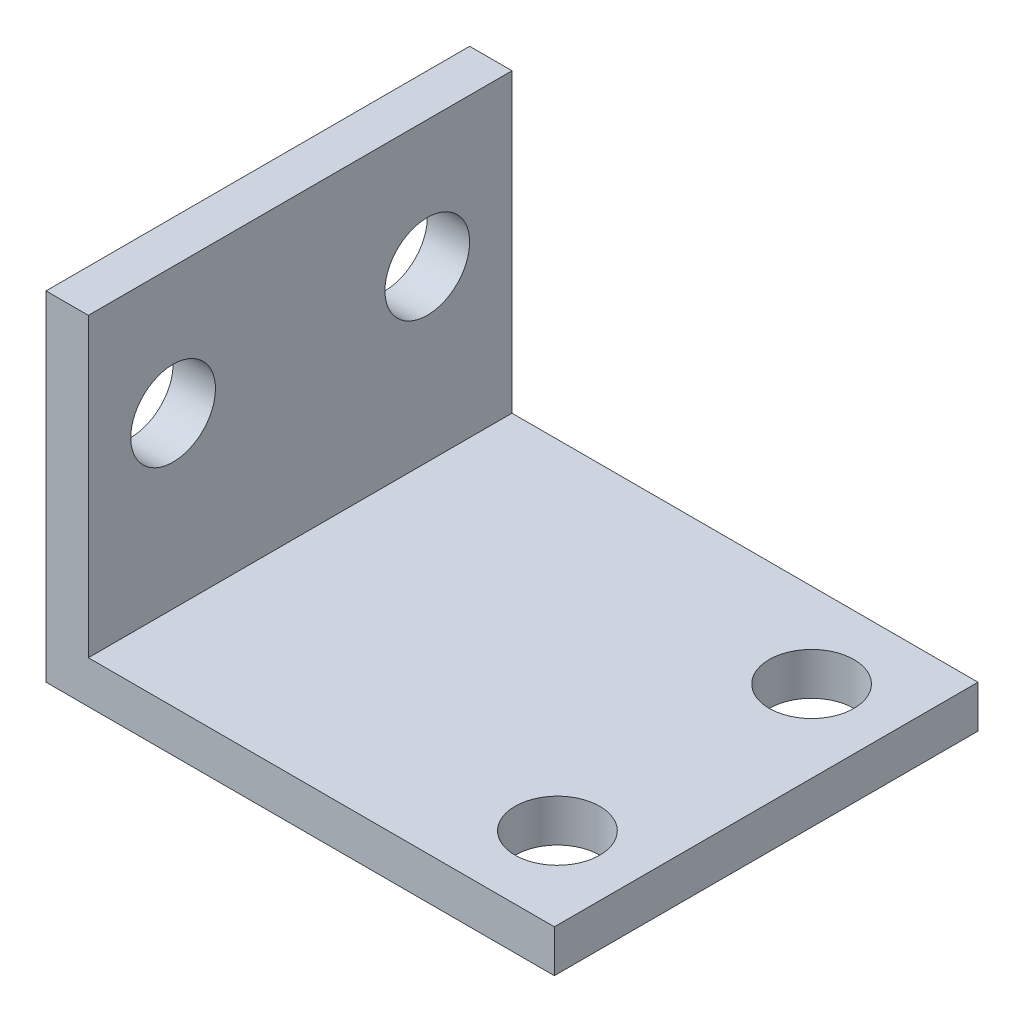
ISO-10303-21;
HEADER;
FILE_DESCRIPTION(('STEP AP214'),'2;1');
FILE_NAME('part.step','',(''),(''),'','','');
FILE_SCHEMA(('AUTOMOTIVE_DESIGN { 1 0 10303 214 1 1 1 1 }'));
ENDSEC;
DATA;
#1=APPLICATION_CONTEXT('core data for automotive mechanical design processes');
#2=APPLICATION_PROTOCOL_DEFINITION('international standard','automotive_design',2000,#1);
#3=PRODUCT_CONTEXT('',#1,'mechanical');
#4=PRODUCT('Part','Part','',(#3));
#5=PRODUCT_RELATED_PRODUCT_CATEGORY('part','',(#4));
#6=PRODUCT_DEFINITION_FORMATION('','',#4);
#7=PRODUCT_DEFINITION_CONTEXT('part definition',#1,'design');
#8=PRODUCT_DEFINITION('design','',#6,#7);
#9=PRODUCT_DEFINITION_SHAPE('','',#8);
#10=(LENGTH_UNIT() NAMED_UNIT(*) SI_UNIT(.MILLI.,.METRE.));
#11=(NAMED_UNIT(*) PLANE_ANGLE_UNIT() SI_UNIT($,.RADIAN.));
#12=(NAMED_UNIT(*) SI_UNIT($,.STERADIAN.) SOLID_ANGLE_UNIT());
#13=UNCERTAINTY_MEASURE_WITH_UNIT(LENGTH_MEASURE(1.E-05),#10,'distance_accuracy_value','');
#14=(GEOMETRIC_REPRESENTATION_CONTEXT(3) GLOBAL_UNCERTAINTY_ASSIGNED_CONTEXT((#13)) GLOBAL_UNIT_ASSIGNED_CONTEXT((#10,
#11,#12)) REPRESENTATION_CONTEXT('',''));
#15=CARTESIAN_POINT('',(0.,0.,0.));
#16=DIRECTION('',(0.,0.,1.));
#17=DIRECTION('',(1.,0.,0.));
#18=AXIS2_PLACEMENT_3D('',#15,#16,#17);
#19=CARTESIAN_POINT('',(38.1,0.,31.75));
#20=DIRECTION('',(0.,1.,0.));
#21=DIRECTION('',(-1.,0.,0.));
#22=AXIS2_PLACEMENT_3D('',#19,#20,#21);
#23=PLANE('',#22);
#24=CARTESIAN_POINT('',(31.9786,0.,25.4));
#25=DIRECTION('',(0.,1.,0.));
#26=DIRECTION('',(-1.,0.,0.));
#27=AXIS2_PLACEMENT_3D('',#24,#25,#26);
#28=CIRCLE('',#27,3.175);
#29=CARTESIAN_POINT('',(28.8036,0.,25.4));
#30=VERTEX_POINT('',#29);
#31=EDGE_CURVE('E162',#30,#30,#28,.T.);
#32=ORIENTED_EDGE('',*,*,#31,.T.);
#33=EDGE_LOOP('',(#32));
#34=FACE_BOUND('',#33,.T.);
#35=CARTESIAN_POINT('',(31.9786,0.,6.35));
#36=DIRECTION('',(0.,1.,0.));
#37=DIRECTION('',(-1.,0.,0.));
#38=AXIS2_PLACEMENT_3D('',#35,#36,#37);
#39=CIRCLE('',#38,3.175);
#40=CARTESIAN_POINT('',(28.8036,0.,6.35));
#41=VERTEX_POINT('',#40);
#42=EDGE_CURVE('E120',#41,#41,#39,.T.);
#43=ORIENTED_EDGE('',*,*,#42,.T.);
#44=EDGE_LOOP('',(#43));
#45=FACE_BOUND('',#44,.T.);
#46=DIRECTION('',(1.,0.,0.));
#47=VECTOR('',#46,1.);
#48=CARTESIAN_POINT('',(38.1,0.,0.));
#49=LINE('',#48,#47);
#50=CARTESIAN_POINT('',(0.,0.,0.));
#51=VERTEX_POINT('',#50);
#52=CARTESIAN_POINT('',(38.1,0.,0.));
#53=VERTEX_POINT('',#52);
#54=EDGE_CURVE('E116',#51,#53,#49,.T.);
#55=ORIENTED_EDGE('',*,*,#54,.T.);
#56=DIRECTION('',(0.,0.,-1.));
#57=VECTOR('',#56,1.);
#58=CARTESIAN_POINT('',(38.1,0.,31.75));
#59=LINE('',#58,#57);
#60=CARTESIAN_POINT('',(38.1,0.,31.75));
#61=VERTEX_POINT('',#60);
#62=EDGE_CURVE('E11',#61,#53,#59,.T.);
#63=ORIENTED_EDGE('',*,*,#62,.F.);
#64=DIRECTION('',(1.,0.,0.));
#65=VECTOR('',#64,1.);
#66=CARTESIAN_POINT('',(38.1,0.,31.75));
#67=LINE('',#66,#65);
#68=CARTESIAN_POINT('',(0.,0.,31.75));
#69=VERTEX_POINT('',#68);
#70=EDGE_CURVE('E127',#69,#61,#67,.T.);
#71=ORIENTED_EDGE('',*,*,#70,.F.);
#72=DIRECTION('',(0.,0.,-1.));
#73=VECTOR('',#72,1.);
#74=CARTESIAN_POINT('',(0.,0.,31.75));
#75=LINE('',#74,#73);
#76=EDGE_CURVE('E112',#69,#51,#75,.T.);
#77=ORIENTED_EDGE('',*,*,#76,.T.);
#78=EDGE_LOOP('',(#55,#63,#71,#77));
#79=FACE_BOUND('',#78,.T.);
#80=ADVANCED_FACE('F32',(#34,#45,#79),#23,.F.);
#81=CARTESIAN_POINT('',(38.1,3.175,31.75));
#82=DIRECTION('',(-1.,0.,0.));
#83=DIRECTION('',(0.,0.,1.));
#84=AXIS2_PLACEMENT_3D('',#81,#82,#83);
#85=PLANE('',#84);
#86=DIRECTION('',(0.,1.,0.));
#87=VECTOR('',#86,1.);
#88=CARTESIAN_POINT('',(38.1,3.175,0.));
#89=LINE('',#88,#87);
#90=CARTESIAN_POINT('',(38.1,3.175,0.));
#91=VERTEX_POINT('',#90);
#92=EDGE_CURVE('E119',#53,#91,#89,.T.);
#93=ORIENTED_EDGE('',*,*,#92,.T.);
#94=DIRECTION('',(0.,0.,-1.));
#95=VECTOR('',#94,1.);
#96=CARTESIAN_POINT('',(38.1,3.175,31.75));
#97=LINE('',#96,#95);
#98=CARTESIAN_POINT('',(38.1,3.175,31.75));
#99=VERTEX_POINT('',#98);
#100=EDGE_CURVE('E40',#99,#91,#97,.T.);
#101=ORIENTED_EDGE('',*,*,#100,.F.);
#102=DIRECTION('',(0.,1.,0.));
#103=VECTOR('',#102,1.);
#104=CARTESIAN_POINT('',(38.1,3.175,31.75));
#105=LINE('',#104,#103);
#106=EDGE_CURVE('E85',#61,#99,#105,.T.);
#107=ORIENTED_EDGE('',*,*,#106,.F.);
#108=ORIENTED_EDGE('',*,*,#62,.T.);
#109=EDGE_LOOP('',(#93,#101,#107,#108));
#110=FACE_BOUND('',#109,.T.);
#111=ADVANCED_FACE('F154',(#110),#85,.F.);
#112=CARTESIAN_POINT('',(3.17500000000001,3.175,31.75));
#113=DIRECTION('',(0.,-1.,0.));
#114=DIRECTION('',(1.,0.,0.));
#115=AXIS2_PLACEMENT_3D('',#112,#113,#114);
#116=PLANE('',#115);
#117=CARTESIAN_POINT('',(31.9786,3.175,25.4));
#118=DIRECTION('',(0.,1.,0.));
#119=DIRECTION('',(-1.,0.,0.));
#120=AXIS2_PLACEMENT_3D('',#117,#118,#119);
#121=CIRCLE('',#120,3.175);
#122=CARTESIAN_POINT('',(28.8036,3.175,25.4));
#123=VERTEX_POINT('',#122);
#124=EDGE_CURVE('E171',#123,#123,#121,.T.);
#125=ORIENTED_EDGE('',*,*,#124,.F.);
#126=EDGE_LOOP('',(#125));
#127=FACE_BOUND('',#126,.T.);
#128=CARTESIAN_POINT('',(31.9786,3.175,6.35));
#129=DIRECTION('',(0.,1.,0.));
#130=DIRECTION('',(-1.,0.,0.));
#131=AXIS2_PLACEMENT_3D('',#128,#129,#130);
#132=CIRCLE('',#131,3.175);
#133=CARTESIAN_POINT('',(28.8036,3.175,6.35));
#134=VERTEX_POINT('',#133);
#135=EDGE_CURVE('E166',#134,#134,#132,.T.);
#136=ORIENTED_EDGE('',*,*,#135,.F.);
#137=EDGE_LOOP('',(#136));
#138=FACE_BOUND('',#137,.T.);
#139=DIRECTION('',(-1.,0.,0.));
#140=VECTOR('',#139,1.);
#141=CARTESIAN_POINT('',(3.17500000000001,3.175,0.));
#142=LINE('',#141,#140);
#143=CARTESIAN_POINT('',(3.17500000000001,3.175,0.));
#144=VERTEX_POINT('',#143);
#145=EDGE_CURVE('E122',#91,#144,#142,.T.);
#146=ORIENTED_EDGE('',*,*,#145,.T.);
#147=DIRECTION('',(0.,0.,-1.));
#148=VECTOR('',#147,1.);
#149=CARTESIAN_POINT('',(3.17500000000001,3.175,31.75));
#150=LINE('',#149,#148);
#151=CARTESIAN_POINT('',(3.17500000000001,3.175,31.75));
#152=VERTEX_POINT('',#151);
#153=EDGE_CURVE('E107',#152,#144,#150,.T.);
#154=ORIENTED_EDGE('',*,*,#153,.F.);
#155=DIRECTION('',(-1.,0.,0.));
#156=VECTOR('',#155,1.);
#157=CARTESIAN_POINT('',(3.17500000000001,3.175,31.75));
#158=LINE('',#157,#156);
#159=EDGE_CURVE('E98',#99,#152,#158,.T.);
#160=ORIENTED_EDGE('',*,*,#159,.F.);
#161=ORIENTED_EDGE('',*,*,#100,.T.);
#162=EDGE_LOOP('',(#146,#154,#160,#161));
#163=FACE_BOUND('',#162,.T.);
#164=ADVANCED_FACE('F133',(#127,#138,#163),#116,.F.);
#165=CARTESIAN_POINT('',(3.175,25.4,31.75));
#166=DIRECTION('',(-1.,0.,0.));
#167=DIRECTION('',(0.,-1.,0.));
#168=AXIS2_PLACEMENT_3D('',#165,#166,#167);
#169=PLANE('',#168);
#170=CARTESIAN_POINT('',(3.175,15.875,6.35));
#171=DIRECTION('',(1.,0.,0.));
#172=DIRECTION('',(0.,1.,0.));
#173=AXIS2_PLACEMENT_3D('',#170,#171,#172);
#174=CIRCLE('',#173,3.175);
#175=CARTESIAN_POINT('',(3.175,19.05,6.35));
#176=VERTEX_POINT('',#175);
#177=EDGE_CURVE('E184',#176,#176,#174,.T.);
#178=ORIENTED_EDGE('',*,*,#177,.F.);
#179=EDGE_LOOP('',(#178));
#180=FACE_BOUND('',#179,.T.);
#181=CARTESIAN_POINT('',(3.175,15.875,25.4));
#182=DIRECTION('',(1.,0.,0.));
#183=DIRECTION('',(0.,1.,0.));
#184=AXIS2_PLACEMENT_3D('',#181,#182,#183);
#185=CIRCLE('',#184,3.175);
#186=CARTESIAN_POINT('',(3.175,19.05,25.4));
#187=VERTEX_POINT('',#186);
#188=EDGE_CURVE('E178',#187,#187,#185,.T.);
#189=ORIENTED_EDGE('',*,*,#188,.F.);
#190=EDGE_LOOP('',(#189));
#191=FACE_BOUND('',#190,.T.);
#192=DIRECTION('',(0.,1.,0.));
#193=VECTOR('',#192,1.);
#194=CARTESIAN_POINT('',(3.175,25.4,0.));
#195=LINE('',#194,#193);
#196=CARTESIAN_POINT('',(3.175,25.4,0.));
#197=VERTEX_POINT('',#196);
#198=EDGE_CURVE('E106',#144,#197,#195,.T.);
#199=ORIENTED_EDGE('',*,*,#198,.T.);
#200=DIRECTION('',(0.,0.,-1.));
#201=VECTOR('',#200,1.);
#202=CARTESIAN_POINT('',(3.175,25.4,31.75));
#203=LINE('',#202,#201);
#204=CARTESIAN_POINT('',(3.175,25.4,31.75));
#205=VERTEX_POINT('',#204);
#206=EDGE_CURVE('E103',#205,#197,#203,.T.);
#207=ORIENTED_EDGE('',*,*,#206,.F.);
#208=DIRECTION('',(0.,1.,0.));
#209=VECTOR('',#208,1.);
#210=CARTESIAN_POINT('',(3.175,25.4,31.75));
#211=LINE('',#210,#209);
#212=EDGE_CURVE('E92',#152,#205,#211,.T.);
#213=ORIENTED_EDGE('',*,*,#212,.F.);
#214=ORIENTED_EDGE('',*,*,#153,.T.);
#215=EDGE_LOOP('',(#199,#207,#213,#214));
#216=FACE_BOUND('',#215,.T.);
#217=ADVANCED_FACE('F104',(#180,#191,#216),#169,.F.);
#218=CARTESIAN_POINT('',(0.,25.4,31.75));
#219=DIRECTION('',(0.,-1.,0.));
#220=DIRECTION('',(0.,0.,-1.));
#221=AXIS2_PLACEMENT_3D('',#218,#219,#220);
#222=PLANE('',#221);
#223=DIRECTION('',(-1.,0.,0.));
#224=VECTOR('',#223,1.);
#225=CARTESIAN_POINT('',(0.,25.4,0.));
#226=LINE('',#225,#224);
#227=CARTESIAN_POINT('',(0.,25.4,0.));
#228=VERTEX_POINT('',#227);
#229=EDGE_CURVE('E71',#197,#228,#226,.T.);
#230=ORIENTED_EDGE('',*,*,#229,.T.);
#231=DIRECTION('',(0.,0.,-1.));
#232=VECTOR('',#231,1.);
#233=CARTESIAN_POINT('',(0.,25.4,31.75));
#234=LINE('',#233,#232);
#235=CARTESIAN_POINT('',(0.,25.4,31.75));
#236=VERTEX_POINT('',#235);
#237=EDGE_CURVE('E108',#236,#228,#234,.T.);
#238=ORIENTED_EDGE('',*,*,#237,.F.);
#239=DIRECTION('',(-1.,0.,0.));
#240=VECTOR('',#239,1.);
#241=CARTESIAN_POINT('',(0.,25.4,31.75));
#242=LINE('',#241,#240);
#243=EDGE_CURVE('E96',#205,#236,#242,.T.);
#244=ORIENTED_EDGE('',*,*,#243,.F.);
#245=ORIENTED_EDGE('',*,*,#206,.T.);
#246=EDGE_LOOP('',(#230,#238,#244,#245));
#247=FACE_BOUND('',#246,.T.);
#248=ADVANCED_FACE('F110',(#247),#222,.F.);
#249=CARTESIAN_POINT('',(0.,0.,31.75));
#250=DIRECTION('',(1.,0.,0.));
#251=DIRECTION('',(0.,0.,-1.));
#252=AXIS2_PLACEMENT_3D('',#249,#250,#251);
#253=PLANE('',#252);
#254=CARTESIAN_POINT('',(0.,15.875,6.35));
#255=DIRECTION('',(1.,0.,0.));
#256=DIRECTION('',(0.,1.,0.));
#257=AXIS2_PLACEMENT_3D('',#254,#255,#256);
#258=CIRCLE('',#257,3.175);
#259=CARTESIAN_POINT('',(0.,19.05,6.35));
#260=VERTEX_POINT('',#259);
#261=EDGE_CURVE('E181',#260,#260,#258,.T.);
#262=ORIENTED_EDGE('',*,*,#261,.T.);
#263=EDGE_LOOP('',(#262));
#264=FACE_BOUND('',#263,.T.);
#265=CARTESIAN_POINT('',(0.,15.875,25.4));
#266=DIRECTION('',(1.,0.,0.));
#267=DIRECTION('',(0.,1.,0.));
#268=AXIS2_PLACEMENT_3D('',#265,#266,#267);
#269=CIRCLE('',#268,3.175);
#270=CARTESIAN_POINT('',(0.,19.05,25.4));
#271=VERTEX_POINT('',#270);
#272=EDGE_CURVE('E176',#271,#271,#269,.T.);
#273=ORIENTED_EDGE('',*,*,#272,.T.);
#274=EDGE_LOOP('',(#273));
#275=FACE_BOUND('',#274,.T.);
#276=DIRECTION('',(0.,-1.,0.));
#277=VECTOR('',#276,1.);
#278=CARTESIAN_POINT('',(0.,0.,0.));
#279=LINE('',#278,#277);
#280=EDGE_CURVE('E77',#228,#51,#279,.T.);
#281=ORIENTED_EDGE('',*,*,#280,.T.);
#282=ORIENTED_EDGE('',*,*,#76,.F.);
#283=DIRECTION('',(0.,-1.,0.));
#284=VECTOR('',#283,1.);
#285=CARTESIAN_POINT('',(0.,0.,31.75));
#286=LINE('',#285,#284);
#287=EDGE_CURVE('E48',#236,#69,#286,.T.);
#288=ORIENTED_EDGE('',*,*,#287,.F.);
#289=ORIENTED_EDGE('',*,*,#237,.T.);
#290=EDGE_LOOP('',(#281,#282,#288,#289));
#291=FACE_BOUND('',#290,.T.);
#292=ADVANCED_FACE('F140',(#264,#275,#291),#253,.F.);
#293=CARTESIAN_POINT('',(0.,0.,31.75));
#294=DIRECTION('',(0.,0.,-1.));
#295=DIRECTION('',(-1.,0.,0.));
#296=AXIS2_PLACEMENT_3D('',#293,#294,#295);
#297=PLANE('',#296);
#298=ORIENTED_EDGE('',*,*,#70,.T.);
#299=ORIENTED_EDGE('',*,*,#106,.T.);
#300=ORIENTED_EDGE('',*,*,#159,.T.);
#301=ORIENTED_EDGE('',*,*,#212,.T.);
#302=ORIENTED_EDGE('',*,*,#243,.T.);
#303=ORIENTED_EDGE('',*,*,#287,.T.);
#304=EDGE_LOOP('',(#298,#299,#300,#301,#302,#303));
#305=FACE_BOUND('',#304,.T.);
#306=ADVANCED_FACE('F94',(#305),#297,.F.);
#307=CARTESIAN_POINT('',(0.,0.,0.));
#308=DIRECTION('',(0.,0.,-1.));
#309=DIRECTION('',(-1.,0.,0.));
#310=AXIS2_PLACEMENT_3D('',#307,#308,#309);
#311=PLANE('',#310);
#312=ORIENTED_EDGE('',*,*,#54,.F.);
#313=ORIENTED_EDGE('',*,*,#280,.F.);
#314=ORIENTED_EDGE('',*,*,#229,.F.);
#315=ORIENTED_EDGE('',*,*,#198,.F.);
#316=ORIENTED_EDGE('',*,*,#145,.F.);
#317=ORIENTED_EDGE('',*,*,#92,.F.);
#318=EDGE_LOOP('',(#312,#313,#314,#315,#316,#317));
#319=FACE_BOUND('',#318,.T.);
#320=ADVANCED_FACE('F136',(#319),#311,.T.);
#321=CARTESIAN_POINT('',(31.9786,0.,6.35));
#322=DIRECTION('',(0.,1.,0.));
#323=DIRECTION('',(-1.,0.,0.));
#324=AXIS2_PLACEMENT_3D('',#321,#322,#323);
#325=CYLINDRICAL_SURFACE('',#324,3.175);
#326=ORIENTED_EDGE('',*,*,#42,.F.);
#327=EDGE_LOOP('',(#326));
#328=FACE_BOUND('',#327,.T.);
#329=ORIENTED_EDGE('',*,*,#135,.T.);
#330=EDGE_LOOP('',(#329));
#331=FACE_BOUND('',#330,.T.);
#332=ADVANCED_FACE('F208',(#328,#331),#325,.F.);
#333=CARTESIAN_POINT('',(31.9786,0.,25.4));
#334=DIRECTION('',(0.,1.,0.));
#335=DIRECTION('',(-1.,0.,0.));
#336=AXIS2_PLACEMENT_3D('',#333,#334,#335);
#337=CYLINDRICAL_SURFACE('',#336,3.175);
#338=ORIENTED_EDGE('',*,*,#31,.F.);
#339=EDGE_LOOP('',(#338));
#340=FACE_BOUND('',#339,.T.);
#341=ORIENTED_EDGE('',*,*,#124,.T.);
#342=EDGE_LOOP('',(#341));
#343=FACE_BOUND('',#342,.T.);
#344=ADVANCED_FACE('F202',(#340,#343),#337,.F.);
#345=CARTESIAN_POINT('',(0.,15.875,25.4));
#346=DIRECTION('',(1.,0.,0.));
#347=DIRECTION('',(0.,1.,0.));
#348=AXIS2_PLACEMENT_3D('',#345,#346,#347);
#349=CYLINDRICAL_SURFACE('',#348,3.175);
#350=ORIENTED_EDGE('',*,*,#272,.F.);
#351=EDGE_LOOP('',(#350));
#352=FACE_BOUND('',#351,.T.);
#353=ORIENTED_EDGE('',*,*,#188,.T.);
#354=EDGE_LOOP('',(#353));
#355=FACE_BOUND('',#354,.T.);
#356=ADVANCED_FACE('F192',(#352,#355),#349,.F.);
#357=CARTESIAN_POINT('',(0.,15.875,6.35));
#358=DIRECTION('',(1.,0.,0.));
#359=DIRECTION('',(0.,1.,0.));
#360=AXIS2_PLACEMENT_3D('',#357,#358,#359);
#361=CYLINDRICAL_SURFACE('',#360,3.175);
#362=ORIENTED_EDGE('',*,*,#261,.F.);
#363=EDGE_LOOP('',(#362));
#364=FACE_BOUND('',#363,.T.);
#365=ORIENTED_EDGE('',*,*,#177,.T.);
#366=EDGE_LOOP('',(#365));
#367=FACE_BOUND('',#366,.T.);
#368=ADVANCED_FACE('F189',(#364,#367),#361,.F.);
#369=CLOSED_SHELL('',(#80,#111,#164,#217,#248,#292,#306,#320,#332,#344,#356,#368));
#370=MANIFOLD_SOLID_BREP('B2',#369);
#371=ADVANCED_BREP_SHAPE_REPRESENTATION('',(#18,#370),#14);
#372=SHAPE_DEFINITION_REPRESENTATION(#9,#371);
ENDSEC;
END-ISO-10303-21;
